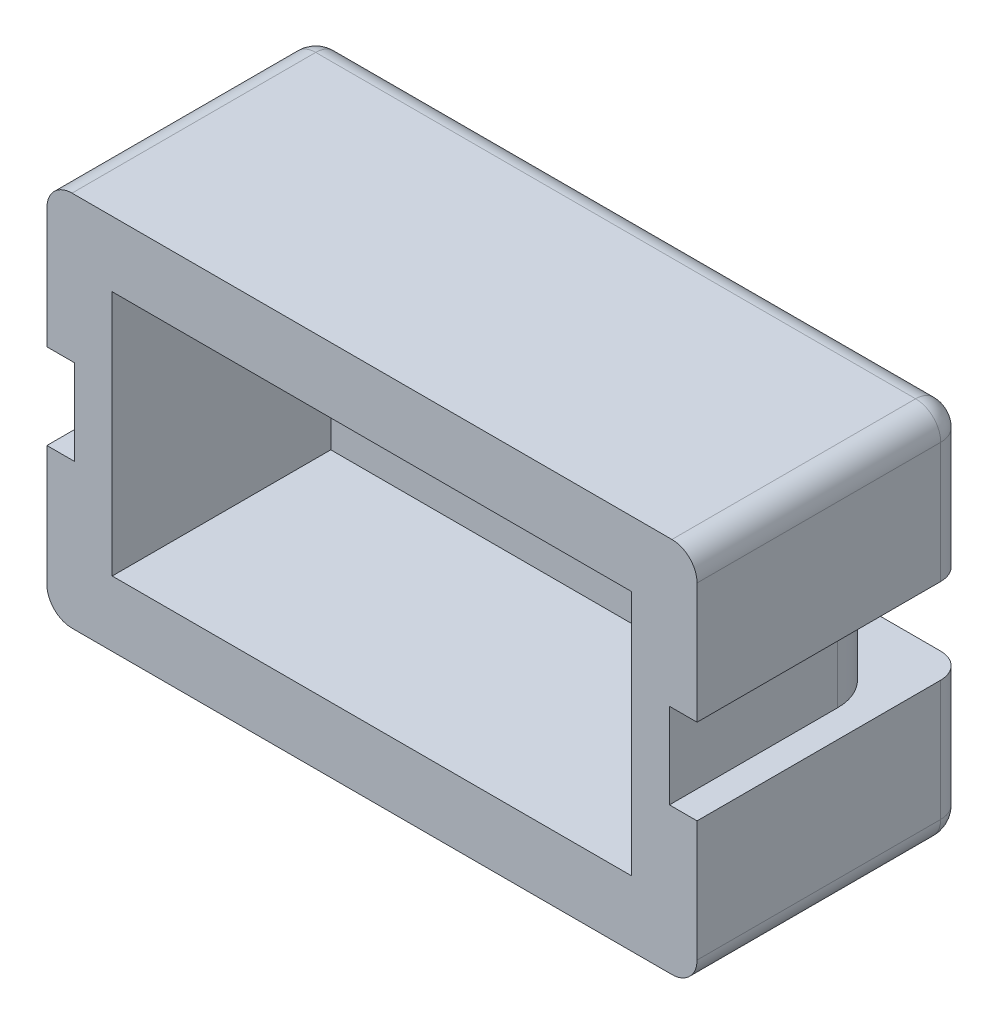
ISO-10303-21;
HEADER;
FILE_DESCRIPTION(('STEP AP214'),'2;1');
FILE_NAME('part.step','',(''),(''),'','','');
FILE_SCHEMA(('AUTOMOTIVE_DESIGN { 1 0 10303 214 1 1 1 1 }'));
ENDSEC;
DATA;
#1=APPLICATION_CONTEXT('core data for automotive mechanical design processes');
#2=APPLICATION_PROTOCOL_DEFINITION('international standard','automotive_design',2000,#1);
#3=PRODUCT_CONTEXT('',#1,'mechanical');
#4=PRODUCT('Part','Part','',(#3));
#5=PRODUCT_RELATED_PRODUCT_CATEGORY('part','',(#4));
#6=PRODUCT_DEFINITION_FORMATION('','',#4);
#7=PRODUCT_DEFINITION_CONTEXT('part definition',#1,'design');
#8=PRODUCT_DEFINITION('design','',#6,#7);
#9=PRODUCT_DEFINITION_SHAPE('','',#8);
#10=(LENGTH_UNIT() NAMED_UNIT(*) SI_UNIT(.MILLI.,.METRE.));
#11=(NAMED_UNIT(*) PLANE_ANGLE_UNIT() SI_UNIT($,.RADIAN.));
#12=(NAMED_UNIT(*) SI_UNIT($,.STERADIAN.) SOLID_ANGLE_UNIT());
#13=UNCERTAINTY_MEASURE_WITH_UNIT(LENGTH_MEASURE(1.E-05),#10,'distance_accuracy_value','');
#14=(GEOMETRIC_REPRESENTATION_CONTEXT(3) GLOBAL_UNCERTAINTY_ASSIGNED_CONTEXT((#13)) GLOBAL_UNIT_ASSIGNED_CONTEXT((#10,
#11,#12)) REPRESENTATION_CONTEXT('',''));
#15=CARTESIAN_POINT('',(0.,0.,0.));
#16=DIRECTION('',(0.,0.,1.));
#17=DIRECTION('',(1.,0.,0.));
#18=AXIS2_PLACEMENT_3D('',#15,#16,#17);
#19=CARTESIAN_POINT('',(-5.17,1.65,-16.7922725015619));
#20=DIRECTION('',(-1.,0.,0.));
#21=DIRECTION('',(0.,0.,1.));
#22=AXIS2_PLACEMENT_3D('',#19,#20,#21);
#23=PLANE('',#22);
#24=DIRECTION('',(0.,1.,0.));
#25=VECTOR('',#24,1.);
#26=CARTESIAN_POINT('',(-5.17,-15.7830852965656,-4.27870878105033));
#27=LINE('',#26,#25);
#28=CARTESIAN_POINT('',(-5.17,0.05,-4.27870878105033));
#29=VERTEX_POINT('',#28);
#30=CARTESIAN_POINT('',(-5.17,-1.65,-4.27870878105033));
#31=VERTEX_POINT('',#30);
#32=EDGE_CURVE('E13',#29,#31,#27,.F.);
#33=ORIENTED_EDGE('',*,*,#32,.F.);
#34=DIRECTION('',(0.,0.,1.));
#35=VECTOR('',#34,1.);
#36=CARTESIAN_POINT('',(-5.17,0.05,-4.35));
#37=LINE('',#36,#35);
#38=CARTESIAN_POINT('',(-5.17,0.05,-4.35));
#39=VERTEX_POINT('',#38);
#40=EDGE_CURVE('E289',#39,#29,#37,.T.);
#41=ORIENTED_EDGE('',*,*,#40,.F.);
#42=DIRECTION('',(0.,1.,0.));
#43=VECTOR('',#42,1.);
#44=CARTESIAN_POINT('',(-5.17,1.65,-4.35));
#45=LINE('',#44,#43);
#46=CARTESIAN_POINT('',(-5.17,1.65,-4.35));
#47=VERTEX_POINT('',#46);
#48=EDGE_CURVE('E298',#39,#47,#45,.T.);
#49=ORIENTED_EDGE('',*,*,#48,.T.);
#50=DIRECTION('',(0.,0.,1.));
#51=VECTOR('',#50,1.);
#52=CARTESIAN_POINT('',(-5.17,1.65,-16.7922725015619));
#53=LINE('',#52,#51);
#54=CARTESIAN_POINT('',(-5.17,1.65,0.));
#55=VERTEX_POINT('',#54);
#56=EDGE_CURVE('E319',#47,#55,#53,.T.);
#57=ORIENTED_EDGE('',*,*,#56,.T.);
#58=DIRECTION('',(0.,-1.,0.));
#59=VECTOR('',#58,1.);
#60=CARTESIAN_POINT('',(-5.17,1.65,0.));
#61=LINE('',#60,#59);
#62=CARTESIAN_POINT('',(-5.17,-3.25,0.));
#63=VERTEX_POINT('',#62);
#64=EDGE_CURVE('E314',#55,#63,#61,.T.);
#65=ORIENTED_EDGE('',*,*,#64,.T.);
#66=DIRECTION('',(0.,0.,1.));
#67=VECTOR('',#66,1.);
#68=CARTESIAN_POINT('',(-5.17,-3.25,-16.7922725015619));
#69=LINE('',#68,#67);
#70=CARTESIAN_POINT('',(-5.17,-3.25,-4.35));
#71=VERTEX_POINT('',#70);
#72=EDGE_CURVE('E299',#71,#63,#69,.T.);
#73=ORIENTED_EDGE('',*,*,#72,.F.);
#74=CARTESIAN_POINT('',(-5.17,-1.65,-4.35));
#75=VERTEX_POINT('',#74);
#76=EDGE_CURVE('E300',#71,#75,#45,.T.);
#77=ORIENTED_EDGE('',*,*,#76,.T.);
#78=DIRECTION('',(0.,0.,-1.));
#79=VECTOR('',#78,1.);
#80=CARTESIAN_POINT('',(-5.17,-1.65,-4.32979589711327));
#81=LINE('',#80,#79);
#82=EDGE_CURVE('E267',#31,#75,#81,.T.);
#83=ORIENTED_EDGE('',*,*,#82,.F.);
#84=EDGE_LOOP('',(#33,#41,#49,#57,#65,#73,#77,#83));
#85=FACE_BOUND('',#84,.T.);
#86=ADVANCED_FACE('F39',(#85),#23,.F.);
#87=CARTESIAN_POINT('',(5.17,-3.25,-16.7922725015619));
#88=DIRECTION('',(1.,0.,0.));
#89=DIRECTION('',(0.,0.,-1.));
#90=AXIS2_PLACEMENT_3D('',#87,#88,#89);
#91=PLANE('',#90);
#92=DIRECTION('',(0.,0.,-1.));
#93=VECTOR('',#92,1.);
#94=CARTESIAN_POINT('',(5.17,0.05,-4.32979589711327));
#95=LINE('',#94,#93);
#96=CARTESIAN_POINT('',(5.17,0.05,-4.27870878105033));
#97=VERTEX_POINT('',#96);
#98=CARTESIAN_POINT('',(5.17,0.05,-4.35));
#99=VERTEX_POINT('',#98);
#100=EDGE_CURVE('E285',#97,#99,#95,.T.);
#101=ORIENTED_EDGE('',*,*,#100,.F.);
#102=DIRECTION('',(0.,1.,0.));
#103=VECTOR('',#102,1.);
#104=CARTESIAN_POINT('',(5.17,-15.7830852965656,-4.27870878105033));
#105=LINE('',#104,#103);
#106=CARTESIAN_POINT('',(5.17,-1.65,-4.27870878105033));
#107=VERTEX_POINT('',#106);
#108=EDGE_CURVE('E47',#107,#97,#105,.T.);
#109=ORIENTED_EDGE('',*,*,#108,.F.);
#110=DIRECTION('',(0.,0.,1.));
#111=VECTOR('',#110,1.);
#112=CARTESIAN_POINT('',(5.17,-1.65,-4.35));
#113=LINE('',#112,#111);
#114=CARTESIAN_POINT('',(5.17,-1.65,-4.35));
#115=VERTEX_POINT('',#114);
#116=EDGE_CURVE('E271',#115,#107,#113,.T.);
#117=ORIENTED_EDGE('',*,*,#116,.F.);
#118=DIRECTION('',(0.,-1.,0.));
#119=VECTOR('',#118,1.);
#120=CARTESIAN_POINT('',(5.17,-3.25,-4.35));
#121=LINE('',#120,#119);
#122=CARTESIAN_POINT('',(5.17,-3.25,-4.35));
#123=VERTEX_POINT('',#122);
#124=EDGE_CURVE('E305',#115,#123,#121,.T.);
#125=ORIENTED_EDGE('',*,*,#124,.T.);
#126=DIRECTION('',(0.,0.,1.));
#127=VECTOR('',#126,1.);
#128=CARTESIAN_POINT('',(5.17,-3.25,-16.7922725015619));
#129=LINE('',#128,#127);
#130=CARTESIAN_POINT('',(5.17,-3.25,0.));
#131=VERTEX_POINT('',#130);
#132=EDGE_CURVE('E316',#123,#131,#129,.T.);
#133=ORIENTED_EDGE('',*,*,#132,.T.);
#134=DIRECTION('',(0.,1.,0.));
#135=VECTOR('',#134,1.);
#136=CARTESIAN_POINT('',(5.17,-3.25,0.));
#137=LINE('',#136,#135);
#138=CARTESIAN_POINT('',(5.17,1.65,0.));
#139=VERTEX_POINT('',#138);
#140=EDGE_CURVE('E308',#131,#139,#137,.T.);
#141=ORIENTED_EDGE('',*,*,#140,.T.);
#142=DIRECTION('',(0.,0.,1.));
#143=VECTOR('',#142,1.);
#144=CARTESIAN_POINT('',(5.17,1.65,-16.7922725015619));
#145=LINE('',#144,#143);
#146=CARTESIAN_POINT('',(5.17,1.65,-4.35));
#147=VERTEX_POINT('',#146);
#148=EDGE_CURVE('E321',#147,#139,#145,.T.);
#149=ORIENTED_EDGE('',*,*,#148,.F.);
#150=EDGE_CURVE('E326',#147,#99,#121,.T.);
#151=ORIENTED_EDGE('',*,*,#150,.T.);
#152=EDGE_LOOP('',(#101,#109,#117,#125,#133,#141,#149,#151));
#153=FACE_BOUND('',#152,.T.);
#154=ADVANCED_FACE('F472',(#153),#91,.F.);
#155=CARTESIAN_POINT('',(0.,0.,0.));
#156=DIRECTION('',(0.,0.,1.));
#157=DIRECTION('',(1.,0.,0.));
#158=AXIS2_PLACEMENT_3D('',#155,#156,#157);
#159=PLANE('',#158);
#160=DIRECTION('',(1.,0.,0.));
#161=VECTOR('',#160,1.);
#162=CARTESIAN_POINT('',(-5.17,-3.25,0.));
#163=LINE('',#162,#161);
#164=EDGE_CURVE('E306',#63,#131,#163,.T.);
#165=ORIENTED_EDGE('',*,*,#164,.F.);
#166=ORIENTED_EDGE('',*,*,#64,.F.);
#167=DIRECTION('',(-1.,0.,0.));
#168=VECTOR('',#167,1.);
#169=CARTESIAN_POINT('',(5.17,1.65,0.));
#170=LINE('',#169,#168);
#171=EDGE_CURVE('E311',#139,#55,#170,.T.);
#172=ORIENTED_EDGE('',*,*,#171,.F.);
#173=ORIENTED_EDGE('',*,*,#140,.F.);
#174=EDGE_LOOP('',(#165,#166,#172,#173));
#175=FACE_BOUND('',#174,.T.);
#176=DIRECTION('',(0.,1.,0.));
#177=VECTOR('',#176,1.);
#178=CARTESIAN_POINT('',(5.92,0.,0.));
#179=LINE('',#178,#177);
#180=CARTESIAN_POINT('',(5.92,-1.65,0.));
#181=VERTEX_POINT('',#180);
#182=CARTESIAN_POINT('',(5.92,0.05,0.));
#183=VERTEX_POINT('',#182);
#184=EDGE_CURVE('E434',#181,#183,#179,.T.);
#185=ORIENTED_EDGE('',*,*,#184,.T.);
#186=DIRECTION('',(-1.,0.,0.));
#187=VECTOR('',#186,1.);
#188=CARTESIAN_POINT('',(6.47,0.05,0.));
#189=LINE('',#188,#187);
#190=CARTESIAN_POINT('',(6.47,0.05,0.));
#191=VERTEX_POINT('',#190);
#192=EDGE_CURVE('E229',#191,#183,#189,.T.);
#193=ORIENTED_EDGE('',*,*,#192,.F.);
#194=DIRECTION('',(0.,1.,0.));
#195=VECTOR('',#194,1.);
#196=CARTESIAN_POINT('',(6.47,-4.55,0.));
#197=LINE('',#196,#195);
#198=CARTESIAN_POINT('',(6.47,2.45,0.));
#199=VERTEX_POINT('',#198);
#200=EDGE_CURVE('E336',#191,#199,#197,.T.);
#201=ORIENTED_EDGE('',*,*,#200,.T.);
#202=CARTESIAN_POINT('',(5.97,2.45,0.));
#203=DIRECTION('',(0.,0.,1.));
#204=DIRECTION('',(1.,0.,0.));
#205=AXIS2_PLACEMENT_3D('',#202,#203,#204);
#206=CIRCLE('',#205,0.5);
#207=CARTESIAN_POINT('',(5.97,2.95,0.));
#208=VERTEX_POINT('',#207);
#209=EDGE_CURVE('E355',#199,#208,#206,.T.);
#210=ORIENTED_EDGE('',*,*,#209,.T.);
#211=DIRECTION('',(-1.,0.,0.));
#212=VECTOR('',#211,1.);
#213=CARTESIAN_POINT('',(6.47,2.95,0.));
#214=LINE('',#213,#212);
#215=CARTESIAN_POINT('',(-5.97,2.95,0.));
#216=VERTEX_POINT('',#215);
#217=EDGE_CURVE('E340',#208,#216,#214,.T.);
#218=ORIENTED_EDGE('',*,*,#217,.T.);
#219=CARTESIAN_POINT('',(-5.97,2.45,0.));
#220=DIRECTION('',(0.,0.,1.));
#221=DIRECTION('',(1.,0.,0.));
#222=AXIS2_PLACEMENT_3D('',#219,#220,#221);
#223=CIRCLE('',#222,0.5);
#224=CARTESIAN_POINT('',(-6.47,2.45,0.));
#225=VERTEX_POINT('',#224);
#226=EDGE_CURVE('E353',#216,#225,#223,.T.);
#227=ORIENTED_EDGE('',*,*,#226,.T.);
#228=DIRECTION('',(0.,-1.,0.));
#229=VECTOR('',#228,1.);
#230=CARTESIAN_POINT('',(-6.47,-4.55,0.));
#231=LINE('',#230,#229);
#232=CARTESIAN_POINT('',(-6.47,0.05,0.));
#233=VERTEX_POINT('',#232);
#234=EDGE_CURVE('E330',#225,#233,#231,.T.);
#235=ORIENTED_EDGE('',*,*,#234,.T.);
#236=DIRECTION('',(-1.,0.,0.));
#237=VECTOR('',#236,1.);
#238=CARTESIAN_POINT('',(-5.97,0.05,0.));
#239=LINE('',#238,#237);
#240=CARTESIAN_POINT('',(-5.92,0.05,0.));
#241=VERTEX_POINT('',#240);
#242=EDGE_CURVE('E291',#241,#233,#239,.T.);
#243=ORIENTED_EDGE('',*,*,#242,.F.);
#244=DIRECTION('',(0.,-1.,0.));
#245=VECTOR('',#244,1.);
#246=CARTESIAN_POINT('',(-5.92,0.,0.));
#247=LINE('',#246,#245);
#248=CARTESIAN_POINT('',(-5.92,-1.65,0.));
#249=VERTEX_POINT('',#248);
#250=EDGE_CURVE('E409',#241,#249,#247,.T.);
#251=ORIENTED_EDGE('',*,*,#250,.T.);
#252=DIRECTION('',(1.,0.,0.));
#253=VECTOR('',#252,1.);
#254=CARTESIAN_POINT('',(-6.47,-1.65,0.));
#255=LINE('',#254,#253);
#256=CARTESIAN_POINT('',(-6.47,-1.65,0.));
#257=VERTEX_POINT('',#256);
#258=EDGE_CURVE('E265',#257,#249,#255,.T.);
#259=ORIENTED_EDGE('',*,*,#258,.F.);
#260=CARTESIAN_POINT('',(-6.47,-4.05,0.));
#261=VERTEX_POINT('',#260);
#262=EDGE_CURVE('E329',#257,#261,#231,.T.);
#263=ORIENTED_EDGE('',*,*,#262,.T.);
#264=CARTESIAN_POINT('',(-5.97,-4.05,0.));
#265=DIRECTION('',(0.,0.,1.));
#266=DIRECTION('',(1.,0.,0.));
#267=AXIS2_PLACEMENT_3D('',#264,#265,#266);
#268=CIRCLE('',#267,0.5);
#269=CARTESIAN_POINT('',(-5.97,-4.55,0.));
#270=VERTEX_POINT('',#269);
#271=EDGE_CURVE('E351',#261,#270,#268,.T.);
#272=ORIENTED_EDGE('',*,*,#271,.T.);
#273=DIRECTION('',(1.,0.,0.));
#274=VECTOR('',#273,1.);
#275=CARTESIAN_POINT('',(6.47,-4.55,0.));
#276=LINE('',#275,#274);
#277=CARTESIAN_POINT('',(5.97,-4.55,0.));
#278=VERTEX_POINT('',#277);
#279=EDGE_CURVE('E333',#270,#278,#276,.T.);
#280=ORIENTED_EDGE('',*,*,#279,.T.);
#281=CARTESIAN_POINT('',(5.97,-4.05,0.));
#282=DIRECTION('',(0.,0.,1.));
#283=DIRECTION('',(1.,0.,0.));
#284=AXIS2_PLACEMENT_3D('',#281,#282,#283);
#285=CIRCLE('',#284,0.5);
#286=CARTESIAN_POINT('',(6.47,-4.05,0.));
#287=VERTEX_POINT('',#286);
#288=EDGE_CURVE('E349',#278,#287,#285,.T.);
#289=ORIENTED_EDGE('',*,*,#288,.T.);
#290=CARTESIAN_POINT('',(6.47,-1.65,0.));
#291=VERTEX_POINT('',#290);
#292=EDGE_CURVE('E337',#287,#291,#197,.T.);
#293=ORIENTED_EDGE('',*,*,#292,.T.);
#294=DIRECTION('',(1.,0.,0.));
#295=VECTOR('',#294,1.);
#296=CARTESIAN_POINT('',(5.97,-1.65,0.));
#297=LINE('',#296,#295);
#298=EDGE_CURVE('E273',#181,#291,#297,.T.);
#299=ORIENTED_EDGE('',*,*,#298,.F.);
#300=EDGE_LOOP('',(#185,#193,#201,#210,#218,#227,#235,#243,#251,#259,#263,#272,#280,#289,#293,#299));
#301=FACE_BOUND('',#300,.T.);
#302=ADVANCED_FACE('F436',(#175,#301),#159,.T.);
#303=CARTESIAN_POINT('',(0.,0.,-4.35));
#304=DIRECTION('',(0.,0.,1.));
#305=DIRECTION('',(1.,0.,0.));
#306=AXIS2_PLACEMENT_3D('',#303,#304,#305);
#307=PLANE('',#306);
#308=ORIENTED_EDGE('',*,*,#124,.F.);
#309=DIRECTION('',(1.,0.,0.));
#310=VECTOR('',#309,1.);
#311=CARTESIAN_POINT('',(-5.17,-1.65,-4.35));
#312=LINE('',#311,#310);
#313=EDGE_CURVE('E269',#75,#115,#312,.T.);
#314=ORIENTED_EDGE('',*,*,#313,.F.);
#315=ORIENTED_EDGE('',*,*,#76,.F.);
#316=DIRECTION('',(-1.,0.,0.));
#317=VECTOR('',#316,1.);
#318=CARTESIAN_POINT('',(-5.17,-3.25,-4.35));
#319=LINE('',#318,#317);
#320=EDGE_CURVE('E303',#123,#71,#319,.T.);
#321=ORIENTED_EDGE('',*,*,#320,.F.);
#322=EDGE_LOOP('',(#308,#314,#315,#321));
#323=FACE_BOUND('',#322,.T.);
#324=ADVANCED_FACE('F468',(#323),#307,.T.);
#325=CARTESIAN_POINT('',(-6.47,-4.55,-5.35));
#326=DIRECTION('',(-1.,0.,0.));
#327=DIRECTION('',(0.,0.,1.));
#328=AXIS2_PLACEMENT_3D('',#325,#326,#327);
#329=PLANE('',#328);
#330=ORIENTED_EDGE('',*,*,#262,.F.);
#331=DIRECTION('',(0.,0.,1.));
#332=VECTOR('',#331,1.);
#333=CARTESIAN_POINT('',(-6.47,-1.65,-4.85));
#334=LINE('',#333,#332);
#335=CARTESIAN_POINT('',(-6.47,-1.65,-4.85));
#336=VERTEX_POINT('',#335);
#337=EDGE_CURVE('E263',#336,#257,#334,.T.);
#338=ORIENTED_EDGE('',*,*,#337,.F.);
#339=DIRECTION('',(0.,-1.,0.));
#340=VECTOR('',#339,1.);
#341=CARTESIAN_POINT('',(-6.47,-4.05,-4.85));
#342=LINE('',#341,#340);
#343=CARTESIAN_POINT('',(-6.47,-4.05,-4.85));
#344=VERTEX_POINT('',#343);
#345=EDGE_CURVE('E391',#336,#344,#342,.T.);
#346=ORIENTED_EDGE('',*,*,#345,.T.);
#347=DIRECTION('',(0.,0.,1.));
#348=VECTOR('',#347,1.);
#349=CARTESIAN_POINT('',(-6.47,-4.05,-5.35));
#350=LINE('',#349,#348);
#351=EDGE_CURVE('E362',#344,#261,#350,.T.);
#352=ORIENTED_EDGE('',*,*,#351,.T.);
#353=EDGE_LOOP('',(#330,#338,#346,#352));
#354=FACE_BOUND('',#353,.T.);
#355=ADVANCED_FACE('F600',(#354),#329,.T.);
#356=CARTESIAN_POINT('',(6.47,-4.55,-5.35));
#357=DIRECTION('',(1.,0.,0.));
#358=DIRECTION('',(0.,0.,-1.));
#359=AXIS2_PLACEMENT_3D('',#356,#357,#358);
#360=PLANE('',#359);
#361=DIRECTION('',(0.,1.,0.));
#362=VECTOR('',#361,1.);
#363=CARTESIAN_POINT('',(6.47,-1.6,-4.85));
#364=LINE('',#363,#362);
#365=CARTESIAN_POINT('',(6.47,-4.05,-4.85));
#366=VERTEX_POINT('',#365);
#367=CARTESIAN_POINT('',(6.47,-1.65,-4.85));
#368=VERTEX_POINT('',#367);
#369=EDGE_CURVE('E404',#366,#368,#364,.T.);
#370=ORIENTED_EDGE('',*,*,#369,.T.);
#371=DIRECTION('',(0.,0.,-1.));
#372=VECTOR('',#371,1.);
#373=CARTESIAN_POINT('',(6.47,-1.65,0.));
#374=LINE('',#373,#372);
#375=EDGE_CURVE('E275',#291,#368,#374,.T.);
#376=ORIENTED_EDGE('',*,*,#375,.F.);
#377=ORIENTED_EDGE('',*,*,#292,.F.);
#378=DIRECTION('',(0.,0.,1.));
#379=VECTOR('',#378,1.);
#380=CARTESIAN_POINT('',(6.47,-4.05,-5.35));
#381=LINE('',#380,#379);
#382=EDGE_CURVE('E343',#287,#366,#381,.F.);
#383=ORIENTED_EDGE('',*,*,#382,.T.);
#384=EDGE_LOOP('',(#370,#376,#377,#383));
#385=FACE_BOUND('',#384,.T.);
#386=ADVANCED_FACE('F606',(#385),#360,.T.);
#387=CARTESIAN_POINT('',(0.,0.,-5.35));
#388=DIRECTION('',(0.,0.,1.));
#389=DIRECTION('',(1.,0.,0.));
#390=AXIS2_PLACEMENT_3D('',#387,#388,#389);
#391=PLANE('',#390);
#392=DIRECTION('',(-1.,0.,0.));
#393=VECTOR('',#392,1.);
#394=CARTESIAN_POINT('',(5.97,-1.65,-5.35));
#395=LINE('',#394,#393);
#396=CARTESIAN_POINT('',(5.97,-1.65,-5.35));
#397=VERTEX_POINT('',#396);
#398=CARTESIAN_POINT('',(-5.97,-1.65,-5.35));
#399=VERTEX_POINT('',#398);
#400=EDGE_CURVE('E54',#397,#399,#395,.T.);
#401=ORIENTED_EDGE('',*,*,#400,.F.);
#402=DIRECTION('',(0.,1.,0.));
#403=VECTOR('',#402,1.);
#404=CARTESIAN_POINT('',(5.97,-4.05,-5.35));
#405=LINE('',#404,#403);
#406=CARTESIAN_POINT('',(5.97,-4.05,-5.35));
#407=VERTEX_POINT('',#406);
#408=EDGE_CURVE('E393',#397,#407,#405,.F.);
#409=ORIENTED_EDGE('',*,*,#408,.T.);
#410=DIRECTION('',(1.,0.,0.));
#411=VECTOR('',#410,1.);
#412=CARTESIAN_POINT('',(-5.97,-4.05,-5.35));
#413=LINE('',#412,#411);
#414=CARTESIAN_POINT('',(-5.97,-4.05,-5.35));
#415=VERTEX_POINT('',#414);
#416=EDGE_CURVE('E395',#407,#415,#413,.F.);
#417=ORIENTED_EDGE('',*,*,#416,.T.);
#418=DIRECTION('',(0.,-1.,0.));
#419=VECTOR('',#418,1.);
#420=CARTESIAN_POINT('',(-5.97,-1.6,-5.35));
#421=LINE('',#420,#419);
#422=EDGE_CURVE('E397',#415,#399,#421,.F.);
#423=ORIENTED_EDGE('',*,*,#422,.T.);
#424=EDGE_LOOP('',(#401,#409,#417,#423));
#425=FACE_BOUND('',#424,.T.);
#426=ADVANCED_FACE('F615',(#425),#391,.F.);
#427=CARTESIAN_POINT('',(5.97,-4.55,-4.85));
#428=DIRECTION('',(0.,-1.,0.));
#429=DIRECTION('',(0.,0.,-1.));
#430=AXIS2_PLACEMENT_3D('',#427,#428,#429);
#431=CYLINDRICAL_SURFACE('',#430,0.5);
#432=ORIENTED_EDGE('',*,*,#408,.F.);
#433=CARTESIAN_POINT('',(5.97,-1.65,-4.85));
#434=DIRECTION('',(0.,1.,0.));
#435=DIRECTION('',(-1.,0.,0.));
#436=AXIS2_PLACEMENT_3D('',#433,#434,#435);
#437=CIRCLE('',#436,0.5);
#438=EDGE_CURVE('E258',#368,#397,#437,.T.);
#439=ORIENTED_EDGE('',*,*,#438,.F.);
#440=ORIENTED_EDGE('',*,*,#369,.F.);
#441=CARTESIAN_POINT('',(5.97,-4.05,-4.85));
#442=DIRECTION('',(0.,-1.,0.));
#443=DIRECTION('',(0.,0.,-1.));
#444=AXIS2_PLACEMENT_3D('',#441,#442,#443);
#445=CIRCLE('',#444,0.5);
#446=EDGE_CURVE('E414',#407,#366,#445,.T.);
#447=ORIENTED_EDGE('',*,*,#446,.F.);
#448=EDGE_LOOP('',(#432,#439,#440,#447));
#449=FACE_BOUND('',#448,.T.);
#450=ADVANCED_FACE('F41',(#449),#431,.T.);
#451=CARTESIAN_POINT('',(-5.97,-4.55,-4.85));
#452=DIRECTION('',(0.,1.,0.));
#453=DIRECTION('',(0.,0.,1.));
#454=AXIS2_PLACEMENT_3D('',#451,#452,#453);
#455=CYLINDRICAL_SURFACE('',#454,0.5);
#456=ORIENTED_EDGE('',*,*,#345,.F.);
#457=CARTESIAN_POINT('',(-5.97,-1.65,-4.85));
#458=DIRECTION('',(0.,1.,0.));
#459=DIRECTION('',(-1.,0.,0.));
#460=AXIS2_PLACEMENT_3D('',#457,#458,#459);
#461=CIRCLE('',#460,0.5);
#462=EDGE_CURVE('E261',#399,#336,#461,.T.);
#463=ORIENTED_EDGE('',*,*,#462,.F.);
#464=ORIENTED_EDGE('',*,*,#422,.F.);
#465=CARTESIAN_POINT('',(-5.97,-4.05,-4.85));
#466=DIRECTION('',(0.,1.,0.));
#467=DIRECTION('',(0.,0.,1.));
#468=AXIS2_PLACEMENT_3D('',#465,#466,#467);
#469=CIRCLE('',#468,0.5);
#470=EDGE_CURVE('E295',#415,#344,#469,.T.);
#471=ORIENTED_EDGE('',*,*,#470,.T.);
#472=EDGE_LOOP('',(#456,#463,#464,#471));
#473=FACE_BOUND('',#472,.T.);
#474=ADVANCED_FACE('F581',(#473),#455,.T.);
#475=DIRECTION('',(0.,-1.,0.));
#476=VECTOR('',#475,1.);
#477=CARTESIAN_POINT('',(-6.47,0.,-4.85));
#478=LINE('',#477,#476);
#479=CARTESIAN_POINT('',(-6.47,2.45,-4.85));
#480=VERTEX_POINT('',#479);
#481=CARTESIAN_POINT('',(-6.47,0.05,-4.85));
#482=VERTEX_POINT('',#481);
#483=EDGE_CURVE('E382',#480,#482,#478,.T.);
#484=ORIENTED_EDGE('',*,*,#483,.T.);
#485=DIRECTION('',(0.,0.,-1.));
#486=VECTOR('',#485,1.);
#487=CARTESIAN_POINT('',(-6.47,0.05,0.));
#488=LINE('',#487,#486);
#489=EDGE_CURVE('E293',#233,#482,#488,.T.);
#490=ORIENTED_EDGE('',*,*,#489,.F.);
#491=ORIENTED_EDGE('',*,*,#234,.F.);
#492=DIRECTION('',(0.,0.,1.));
#493=VECTOR('',#492,1.);
#494=CARTESIAN_POINT('',(-6.47,2.45,-5.35));
#495=LINE('',#494,#493);
#496=EDGE_CURVE('E365',#225,#480,#495,.F.);
#497=ORIENTED_EDGE('',*,*,#496,.T.);
#498=EDGE_LOOP('',(#484,#490,#491,#497));
#499=FACE_BOUND('',#498,.T.);
#500=ADVANCED_FACE('F609',(#499),#329,.T.);
#501=ORIENTED_EDGE('',*,*,#200,.F.);
#502=DIRECTION('',(0.,0.,1.));
#503=VECTOR('',#502,1.);
#504=CARTESIAN_POINT('',(6.47,0.05,-4.85));
#505=LINE('',#504,#503);
#506=CARTESIAN_POINT('',(6.47,0.05,-4.85));
#507=VERTEX_POINT('',#506);
#508=EDGE_CURVE('E282',#507,#191,#505,.T.);
#509=ORIENTED_EDGE('',*,*,#508,.F.);
#510=DIRECTION('',(0.,1.,0.));
#511=VECTOR('',#510,1.);
#512=CARTESIAN_POINT('',(6.47,2.45,-4.85));
#513=LINE('',#512,#511);
#514=CARTESIAN_POINT('',(6.47,2.45,-4.85));
#515=VERTEX_POINT('',#514);
#516=EDGE_CURVE('E373',#507,#515,#513,.T.);
#517=ORIENTED_EDGE('',*,*,#516,.T.);
#518=DIRECTION('',(0.,0.,1.));
#519=VECTOR('',#518,1.);
#520=CARTESIAN_POINT('',(6.47,2.45,-5.35));
#521=LINE('',#520,#519);
#522=EDGE_CURVE('E346',#515,#199,#521,.T.);
#523=ORIENTED_EDGE('',*,*,#522,.T.);
#524=EDGE_LOOP('',(#501,#509,#517,#523));
#525=FACE_BOUND('',#524,.T.);
#526=ADVANCED_FACE('F618',(#525),#360,.T.);
#527=DIRECTION('',(1.,0.,0.));
#528=VECTOR('',#527,1.);
#529=CARTESIAN_POINT('',(-5.97,0.05,-5.35));
#530=LINE('',#529,#528);
#531=CARTESIAN_POINT('',(-5.97,0.05,-5.35));
#532=VERTEX_POINT('',#531);
#533=CARTESIAN_POINT('',(5.97,0.0499999999999997,-5.35));
#534=VERTEX_POINT('',#533);
#535=EDGE_CURVE('E62',#532,#534,#530,.T.);
#536=ORIENTED_EDGE('',*,*,#535,.F.);
#537=DIRECTION('',(0.,-1.,0.));
#538=VECTOR('',#537,1.);
#539=CARTESIAN_POINT('',(-5.97,2.45,-5.35));
#540=LINE('',#539,#538);
#541=CARTESIAN_POINT('',(-5.97,2.45,-5.35));
#542=VERTEX_POINT('',#541);
#543=EDGE_CURVE('E377',#532,#542,#540,.F.);
#544=ORIENTED_EDGE('',*,*,#543,.T.);
#545=DIRECTION('',(-1.,0.,0.));
#546=VECTOR('',#545,1.);
#547=CARTESIAN_POINT('',(5.97,2.45,-5.35));
#548=LINE('',#547,#546);
#549=CARTESIAN_POINT('',(5.97,2.45,-5.35));
#550=VERTEX_POINT('',#549);
#551=EDGE_CURVE('E375',#542,#550,#548,.F.);
#552=ORIENTED_EDGE('',*,*,#551,.T.);
#553=DIRECTION('',(0.,1.,0.));
#554=VECTOR('',#553,1.);
#555=CARTESIAN_POINT('',(5.97,0.,-5.35));
#556=LINE('',#555,#554);
#557=EDGE_CURVE('E379',#550,#534,#556,.F.);
#558=ORIENTED_EDGE('',*,*,#557,.T.);
#559=EDGE_LOOP('',(#536,#544,#552,#558));
#560=FACE_BOUND('',#559,.T.);
#561=ADVANCED_FACE('F512',(#560),#391,.F.);
#562=ORIENTED_EDGE('',*,*,#48,.F.);
#563=DIRECTION('',(-1.,0.,0.));
#564=VECTOR('',#563,1.);
#565=CARTESIAN_POINT('',(5.17,0.05,-4.35));
#566=LINE('',#565,#564);
#567=EDGE_CURVE('E287',#99,#39,#566,.T.);
#568=ORIENTED_EDGE('',*,*,#567,.F.);
#569=ORIENTED_EDGE('',*,*,#150,.F.);
#570=DIRECTION('',(1.,0.,0.));
#571=VECTOR('',#570,1.);
#572=CARTESIAN_POINT('',(5.17,1.65,-4.35));
#573=LINE('',#572,#571);
#574=EDGE_CURVE('E296',#47,#147,#573,.T.);
#575=ORIENTED_EDGE('',*,*,#574,.F.);
#576=EDGE_LOOP('',(#562,#568,#569,#575));
#577=FACE_BOUND('',#576,.T.);
#578=ADVANCED_FACE('F478',(#577),#307,.T.);
#579=CARTESIAN_POINT('',(-5.97,-4.55,-4.85));
#580=DIRECTION('',(0.,1.,0.));
#581=DIRECTION('',(0.,0.,1.));
#582=AXIS2_PLACEMENT_3D('',#579,#580,#581);
#583=CYLINDRICAL_SURFACE('',#582,0.5);
#584=ORIENTED_EDGE('',*,*,#543,.F.);
#585=CARTESIAN_POINT('',(-5.97,0.05,-4.85));
#586=DIRECTION('',(0.,-1.,0.));
#587=DIRECTION('',(0.,0.,-1.));
#588=AXIS2_PLACEMENT_3D('',#585,#586,#587);
#589=CIRCLE('',#588,0.5);
#590=EDGE_CURVE('E277',#482,#532,#589,.T.);
#591=ORIENTED_EDGE('',*,*,#590,.F.);
#592=ORIENTED_EDGE('',*,*,#483,.F.);
#593=CARTESIAN_POINT('',(-5.97,2.45,-4.85));
#594=DIRECTION('',(0.,1.,0.));
#595=DIRECTION('',(0.,0.,1.));
#596=AXIS2_PLACEMENT_3D('',#593,#594,#595);
#597=CIRCLE('',#596,0.5);
#598=EDGE_CURVE('E309',#542,#480,#597,.T.);
#599=ORIENTED_EDGE('',*,*,#598,.F.);
#600=EDGE_LOOP('',(#584,#591,#592,#599));
#601=FACE_BOUND('',#600,.T.);
#602=ADVANCED_FACE('F511',(#601),#583,.T.);
#603=CARTESIAN_POINT('',(5.97,-4.55,-4.85));
#604=DIRECTION('',(0.,-1.,0.));
#605=DIRECTION('',(0.,0.,-1.));
#606=AXIS2_PLACEMENT_3D('',#603,#604,#605);
#607=CYLINDRICAL_SURFACE('',#606,0.5);
#608=ORIENTED_EDGE('',*,*,#516,.F.);
#609=CARTESIAN_POINT('',(5.97,0.05,-4.85));
#610=DIRECTION('',(0.,-1.,0.));
#611=DIRECTION('',(0.,0.,-1.));
#612=AXIS2_PLACEMENT_3D('',#609,#610,#611);
#613=CIRCLE('',#612,0.5);
#614=EDGE_CURVE('E280',#534,#507,#613,.T.);
#615=ORIENTED_EDGE('',*,*,#614,.F.);
#616=ORIENTED_EDGE('',*,*,#557,.F.);
#617=CARTESIAN_POINT('',(5.97,2.45,-4.85));
#618=DIRECTION('',(0.,-1.,0.));
#619=DIRECTION('',(0.,0.,-1.));
#620=AXIS2_PLACEMENT_3D('',#617,#618,#619);
#621=CIRCLE('',#620,0.5);
#622=EDGE_CURVE('E410',#550,#515,#621,.T.);
#623=ORIENTED_EDGE('',*,*,#622,.T.);
#624=EDGE_LOOP('',(#608,#615,#616,#623));
#625=FACE_BOUND('',#624,.T.);
#626=ADVANCED_FACE('F660',(#625),#607,.T.);
#627=CARTESIAN_POINT('',(6.47,2.95,-5.35));
#628=DIRECTION('',(0.,1.,0.));
#629=DIRECTION('',(0.,0.,1.));
#630=AXIS2_PLACEMENT_3D('',#627,#628,#629);
#631=PLANE('',#630);
#632=DIRECTION('',(0.,0.,1.));
#633=VECTOR('',#632,1.);
#634=CARTESIAN_POINT('',(5.97,2.95,-5.35));
#635=LINE('',#634,#633);
#636=CARTESIAN_POINT('',(5.97,2.95,-4.85));
#637=VERTEX_POINT('',#636);
#638=EDGE_CURVE('E359',#208,#637,#635,.F.);
#639=ORIENTED_EDGE('',*,*,#638,.T.);
#640=DIRECTION('',(-1.,0.,0.));
#641=VECTOR('',#640,1.);
#642=CARTESIAN_POINT('',(-5.97,2.95,-4.85));
#643=LINE('',#642,#641);
#644=CARTESIAN_POINT('',(-5.97,2.95,-4.85));
#645=VERTEX_POINT('',#644);
#646=EDGE_CURVE('E387',#637,#645,#643,.T.);
#647=ORIENTED_EDGE('',*,*,#646,.T.);
#648=DIRECTION('',(0.,0.,1.));
#649=VECTOR('',#648,1.);
#650=CARTESIAN_POINT('',(-5.97,2.95,-5.35));
#651=LINE('',#650,#649);
#652=EDGE_CURVE('E357',#645,#216,#651,.T.);
#653=ORIENTED_EDGE('',*,*,#652,.T.);
#654=ORIENTED_EDGE('',*,*,#217,.F.);
#655=EDGE_LOOP('',(#639,#647,#653,#654));
#656=FACE_BOUND('',#655,.T.);
#657=ADVANCED_FACE('F667',(#656),#631,.T.);
#658=CARTESIAN_POINT('',(6.47,-4.55,-5.35));
#659=DIRECTION('',(0.,-1.,0.));
#660=DIRECTION('',(0.,0.,-1.));
#661=AXIS2_PLACEMENT_3D('',#658,#659,#660);
#662=PLANE('',#661);
#663=DIRECTION('',(0.,0.,1.));
#664=VECTOR('',#663,1.);
#665=CARTESIAN_POINT('',(-5.97,-4.55,-5.35));
#666=LINE('',#665,#664);
#667=CARTESIAN_POINT('',(-5.97,-4.55,-4.85));
#668=VERTEX_POINT('',#667);
#669=EDGE_CURVE('E370',#270,#668,#666,.F.);
#670=ORIENTED_EDGE('',*,*,#669,.T.);
#671=DIRECTION('',(1.,0.,0.));
#672=VECTOR('',#671,1.);
#673=CARTESIAN_POINT('',(5.97,-4.55,-4.85));
#674=LINE('',#673,#672);
#675=CARTESIAN_POINT('',(5.97,-4.55,-4.85));
#676=VERTEX_POINT('',#675);
#677=EDGE_CURVE('E402',#668,#676,#674,.T.);
#678=ORIENTED_EDGE('',*,*,#677,.T.);
#679=DIRECTION('',(0.,0.,1.));
#680=VECTOR('',#679,1.);
#681=CARTESIAN_POINT('',(5.97,-4.55,-5.35));
#682=LINE('',#681,#680);
#683=EDGE_CURVE('E368',#676,#278,#682,.T.);
#684=ORIENTED_EDGE('',*,*,#683,.T.);
#685=ORIENTED_EDGE('',*,*,#279,.F.);
#686=EDGE_LOOP('',(#670,#678,#684,#685));
#687=FACE_BOUND('',#686,.T.);
#688=ADVANCED_FACE('F675',(#687),#662,.T.);
#689=CARTESIAN_POINT('',(5.97,2.45,-5.35));
#690=DIRECTION('',(0.,0.,1.));
#691=DIRECTION('',(1.,0.,0.));
#692=AXIS2_PLACEMENT_3D('',#689,#690,#691);
#693=CYLINDRICAL_SURFACE('',#692,0.5);
#694=ORIENTED_EDGE('',*,*,#522,.F.);
#695=CARTESIAN_POINT('',(5.97,2.45,-4.85));
#696=DIRECTION('',(0.,0.,1.));
#697=DIRECTION('',(1.,0.,0.));
#698=AXIS2_PLACEMENT_3D('',#695,#696,#697);
#699=CIRCLE('',#698,0.5);
#700=EDGE_CURVE('E389',#515,#637,#699,.T.);
#701=ORIENTED_EDGE('',*,*,#700,.T.);
#702=ORIENTED_EDGE('',*,*,#638,.F.);
#703=ORIENTED_EDGE('',*,*,#209,.F.);
#704=EDGE_LOOP('',(#694,#701,#702,#703));
#705=FACE_BOUND('',#704,.T.);
#706=ADVANCED_FACE('F684',(#705),#693,.T.);
#707=CARTESIAN_POINT('',(-5.97,2.45,-5.35));
#708=DIRECTION('',(0.,0.,1.));
#709=DIRECTION('',(1.,0.,0.));
#710=AXIS2_PLACEMENT_3D('',#707,#708,#709);
#711=CYLINDRICAL_SURFACE('',#710,0.5);
#712=ORIENTED_EDGE('',*,*,#652,.F.);
#713=CARTESIAN_POINT('',(-5.97,2.45,-4.85));
#714=DIRECTION('',(0.,0.,1.));
#715=DIRECTION('',(1.,0.,0.));
#716=AXIS2_PLACEMENT_3D('',#713,#714,#715);
#717=CIRCLE('',#716,0.5);
#718=EDGE_CURVE('E385',#645,#480,#717,.T.);
#719=ORIENTED_EDGE('',*,*,#718,.T.);
#720=ORIENTED_EDGE('',*,*,#496,.F.);
#721=ORIENTED_EDGE('',*,*,#226,.F.);
#722=EDGE_LOOP('',(#712,#719,#720,#721));
#723=FACE_BOUND('',#722,.T.);
#724=ADVANCED_FACE('F692',(#723),#711,.T.);
#725=CARTESIAN_POINT('',(-5.97,-4.05,-5.35));
#726=DIRECTION('',(0.,0.,1.));
#727=DIRECTION('',(1.,0.,0.));
#728=AXIS2_PLACEMENT_3D('',#725,#726,#727);
#729=CYLINDRICAL_SURFACE('',#728,0.5);
#730=ORIENTED_EDGE('',*,*,#351,.F.);
#731=CARTESIAN_POINT('',(-5.97,-4.05,-4.85));
#732=DIRECTION('',(0.,0.,1.));
#733=DIRECTION('',(1.,0.,0.));
#734=AXIS2_PLACEMENT_3D('',#731,#732,#733);
#735=CIRCLE('',#734,0.5);
#736=EDGE_CURVE('E400',#344,#668,#735,.T.);
#737=ORIENTED_EDGE('',*,*,#736,.T.);
#738=ORIENTED_EDGE('',*,*,#669,.F.);
#739=ORIENTED_EDGE('',*,*,#271,.F.);
#740=EDGE_LOOP('',(#730,#737,#738,#739));
#741=FACE_BOUND('',#740,.T.);
#742=ADVANCED_FACE('F498',(#741),#729,.T.);
#743=CARTESIAN_POINT('',(5.97,-4.05,-5.35));
#744=DIRECTION('',(0.,0.,1.));
#745=DIRECTION('',(1.,0.,0.));
#746=AXIS2_PLACEMENT_3D('',#743,#744,#745);
#747=CYLINDRICAL_SURFACE('',#746,0.5);
#748=ORIENTED_EDGE('',*,*,#683,.F.);
#749=CARTESIAN_POINT('',(5.97,-4.05,-4.85));
#750=DIRECTION('',(0.,0.,1.));
#751=DIRECTION('',(1.,0.,0.));
#752=AXIS2_PLACEMENT_3D('',#749,#750,#751);
#753=CIRCLE('',#752,0.5);
#754=EDGE_CURVE('E407',#676,#366,#753,.T.);
#755=ORIENTED_EDGE('',*,*,#754,.T.);
#756=ORIENTED_EDGE('',*,*,#382,.F.);
#757=ORIENTED_EDGE('',*,*,#288,.F.);
#758=EDGE_LOOP('',(#748,#755,#756,#757));
#759=FACE_BOUND('',#758,.T.);
#760=ADVANCED_FACE('F490',(#759),#747,.T.);
#761=CARTESIAN_POINT('',(-5.17,-3.25,-16.7922725015619));
#762=DIRECTION('',(0.,-1.,0.));
#763=DIRECTION('',(0.,0.,-1.));
#764=AXIS2_PLACEMENT_3D('',#761,#762,#763);
#765=PLANE('',#764);
#766=ORIENTED_EDGE('',*,*,#320,.T.);
#767=ORIENTED_EDGE('',*,*,#72,.T.);
#768=ORIENTED_EDGE('',*,*,#164,.T.);
#769=ORIENTED_EDGE('',*,*,#132,.F.);
#770=EDGE_LOOP('',(#766,#767,#768,#769));
#771=FACE_BOUND('',#770,.T.);
#772=ADVANCED_FACE('F488',(#771),#765,.F.);
#773=CARTESIAN_POINT('',(5.17,1.65,-16.7922725015619));
#774=DIRECTION('',(0.,1.,0.));
#775=DIRECTION('',(0.,0.,1.));
#776=AXIS2_PLACEMENT_3D('',#773,#774,#775);
#777=PLANE('',#776);
#778=ORIENTED_EDGE('',*,*,#574,.T.);
#779=ORIENTED_EDGE('',*,*,#148,.T.);
#780=ORIENTED_EDGE('',*,*,#171,.T.);
#781=ORIENTED_EDGE('',*,*,#56,.F.);
#782=EDGE_LOOP('',(#778,#779,#780,#781));
#783=FACE_BOUND('',#782,.T.);
#784=ADVANCED_FACE('F484',(#783),#777,.F.);
#785=CARTESIAN_POINT('',(-5.97,2.45,-4.85));
#786=DIRECTION('',(0.,0.,1.));
#787=DIRECTION('',(1.,0.,0.));
#788=AXIS2_PLACEMENT_3D('',#785,#786,#787);
#789=SPHERICAL_SURFACE('',#788,0.5);
#790=ORIENTED_EDGE('',*,*,#598,.T.);
#791=ORIENTED_EDGE('',*,*,#718,.F.);
#792=CARTESIAN_POINT('',(-5.97,2.45,-4.85));
#793=DIRECTION('',(1.,0.,0.));
#794=DIRECTION('',(0.,0.,-1.));
#795=AXIS2_PLACEMENT_3D('',#792,#793,#794);
#796=CIRCLE('',#795,0.5);
#797=EDGE_CURVE('E417',#542,#645,#796,.T.);
#798=ORIENTED_EDGE('',*,*,#797,.F.);
#799=EDGE_LOOP('',(#790,#791,#798));
#800=FACE_BOUND('',#799,.T.);
#801=ADVANCED_FACE('F496',(#800),#789,.T.);
#802=CARTESIAN_POINT('',(6.47,2.45,-4.85));
#803=DIRECTION('',(1.,0.,0.));
#804=DIRECTION('',(0.,0.,-1.));
#805=AXIS2_PLACEMENT_3D('',#802,#803,#804);
#806=CYLINDRICAL_SURFACE('',#805,0.5);
#807=ORIENTED_EDGE('',*,*,#797,.T.);
#808=ORIENTED_EDGE('',*,*,#646,.F.);
#809=CARTESIAN_POINT('',(5.97,2.45,-4.85));
#810=DIRECTION('',(1.,0.,0.));
#811=DIRECTION('',(0.,0.,-1.));
#812=AXIS2_PLACEMENT_3D('',#809,#810,#811);
#813=CIRCLE('',#812,0.5);
#814=EDGE_CURVE('E413',#550,#637,#813,.T.);
#815=ORIENTED_EDGE('',*,*,#814,.F.);
#816=ORIENTED_EDGE('',*,*,#551,.F.);
#817=EDGE_LOOP('',(#807,#808,#815,#816));
#818=FACE_BOUND('',#817,.T.);
#819=ADVANCED_FACE('F722',(#818),#806,.T.);
#820=CARTESIAN_POINT('',(5.97,2.45,-4.85));
#821=DIRECTION('',(0.,0.,1.));
#822=DIRECTION('',(1.,0.,0.));
#823=AXIS2_PLACEMENT_3D('',#820,#821,#822);
#824=SPHERICAL_SURFACE('',#823,0.5);
#825=ORIENTED_EDGE('',*,*,#814,.T.);
#826=ORIENTED_EDGE('',*,*,#700,.F.);
#827=ORIENTED_EDGE('',*,*,#622,.F.);
#828=EDGE_LOOP('',(#825,#826,#827));
#829=FACE_BOUND('',#828,.T.);
#830=ADVANCED_FACE('F734',(#829),#824,.T.);
#831=CARTESIAN_POINT('',(5.97,-4.05,-4.85));
#832=DIRECTION('',(0.,0.,1.));
#833=DIRECTION('',(1.,0.,0.));
#834=AXIS2_PLACEMENT_3D('',#831,#832,#833);
#835=SPHERICAL_SURFACE('',#834,0.5);
#836=ORIENTED_EDGE('',*,*,#446,.T.);
#837=ORIENTED_EDGE('',*,*,#754,.F.);
#838=CARTESIAN_POINT('',(5.97,-4.05,-4.85));
#839=DIRECTION('',(-1.,0.,0.));
#840=DIRECTION('',(0.,0.,1.));
#841=AXIS2_PLACEMENT_3D('',#838,#839,#840);
#842=CIRCLE('',#841,0.5);
#843=EDGE_CURVE('E427',#407,#676,#842,.T.);
#844=ORIENTED_EDGE('',*,*,#843,.F.);
#845=EDGE_LOOP('',(#836,#837,#844));
#846=FACE_BOUND('',#845,.T.);
#847=ADVANCED_FACE('F744',(#846),#835,.T.);
#848=CARTESIAN_POINT('',(6.47,-4.05,-4.85));
#849=DIRECTION('',(-1.,0.,0.));
#850=DIRECTION('',(0.,0.,1.));
#851=AXIS2_PLACEMENT_3D('',#848,#849,#850);
#852=CYLINDRICAL_SURFACE('',#851,0.5);
#853=ORIENTED_EDGE('',*,*,#843,.T.);
#854=ORIENTED_EDGE('',*,*,#677,.F.);
#855=CARTESIAN_POINT('',(-5.97,-4.05,-4.85));
#856=DIRECTION('',(-1.,0.,0.));
#857=DIRECTION('',(0.,0.,1.));
#858=AXIS2_PLACEMENT_3D('',#855,#856,#857);
#859=CIRCLE('',#858,0.5);
#860=EDGE_CURVE('E424',#415,#668,#859,.T.);
#861=ORIENTED_EDGE('',*,*,#860,.F.);
#862=ORIENTED_EDGE('',*,*,#416,.F.);
#863=EDGE_LOOP('',(#853,#854,#861,#862));
#864=FACE_BOUND('',#863,.T.);
#865=ADVANCED_FACE('F755',(#864),#852,.T.);
#866=CARTESIAN_POINT('',(-5.97,-4.05,-4.85));
#867=DIRECTION('',(0.,0.,1.));
#868=DIRECTION('',(1.,0.,0.));
#869=AXIS2_PLACEMENT_3D('',#866,#867,#868);
#870=SPHERICAL_SURFACE('',#869,0.5);
#871=ORIENTED_EDGE('',*,*,#860,.T.);
#872=ORIENTED_EDGE('',*,*,#736,.F.);
#873=ORIENTED_EDGE('',*,*,#470,.F.);
#874=EDGE_LOOP('',(#871,#872,#873));
#875=FACE_BOUND('',#874,.T.);
#876=ADVANCED_FACE('F515',(#875),#870,.T.);
#877=CARTESIAN_POINT('',(-5.97,0.05,-4.85));
#878=DIRECTION('',(0.,-1.,0.));
#879=DIRECTION('',(0.,0.,-1.));
#880=AXIS2_PLACEMENT_3D('',#877,#878,#879);
#881=PLANE('',#880);
#882=CARTESIAN_POINT('',(4.97,0.05,-3.35));
#883=DIRECTION('',(0.,1.,0.));
#884=DIRECTION('',(0.,0.,-1.));
#885=AXIS2_PLACEMENT_3D('',#882,#883,#884);
#886=CIRCLE('',#885,0.950000000000001);
#887=CARTESIAN_POINT('',(5.92,0.05,-3.35));
#888=VERTEX_POINT('',#887);
#889=EDGE_CURVE('E227',#888,#97,#886,.T.);
#890=ORIENTED_EDGE('',*,*,#889,.T.);
#891=ORIENTED_EDGE('',*,*,#100,.T.);
#892=ORIENTED_EDGE('',*,*,#567,.T.);
#893=ORIENTED_EDGE('',*,*,#40,.T.);
#894=CARTESIAN_POINT('',(-4.97,0.05,-3.35));
#895=DIRECTION('',(0.,1.,0.));
#896=DIRECTION('',(0.,0.,-1.));
#897=AXIS2_PLACEMENT_3D('',#894,#895,#896);
#898=CIRCLE('',#897,0.95);
#899=CARTESIAN_POINT('',(-5.92,0.05,-3.35));
#900=VERTEX_POINT('',#899);
#901=EDGE_CURVE('E248',#29,#900,#898,.T.);
#902=ORIENTED_EDGE('',*,*,#901,.T.);
#903=DIRECTION('',(0.,0.,1.));
#904=VECTOR('',#903,1.);
#905=CARTESIAN_POINT('',(-5.92,0.05,-3.35));
#906=LINE('',#905,#904);
#907=EDGE_CURVE('E250',#900,#241,#906,.T.);
#908=ORIENTED_EDGE('',*,*,#907,.T.);
#909=ORIENTED_EDGE('',*,*,#242,.T.);
#910=ORIENTED_EDGE('',*,*,#489,.T.);
#911=ORIENTED_EDGE('',*,*,#590,.T.);
#912=ORIENTED_EDGE('',*,*,#535,.T.);
#913=ORIENTED_EDGE('',*,*,#614,.T.);
#914=ORIENTED_EDGE('',*,*,#508,.T.);
#915=ORIENTED_EDGE('',*,*,#192,.T.);
#916=DIRECTION('',(0.,0.,-1.));
#917=VECTOR('',#916,1.);
#918=CARTESIAN_POINT('',(5.92,0.05,0.05));
#919=LINE('',#918,#917);
#920=EDGE_CURVE('E223',#183,#888,#919,.T.);
#921=ORIENTED_EDGE('',*,*,#920,.T.);
#922=EDGE_LOOP('',(#890,#891,#892,#893,#902,#908,#909,#910,#911,#912,#913,#914,#915,#921));
#923=FACE_BOUND('',#922,.T.);
#924=ADVANCED_FACE('F225',(#923),#881,.T.);
#925=CARTESIAN_POINT('',(5.97,-1.65,-4.85));
#926=DIRECTION('',(0.,1.,0.));
#927=DIRECTION('',(-1.,0.,0.));
#928=AXIS2_PLACEMENT_3D('',#925,#926,#927);
#929=PLANE('',#928);
#930=CARTESIAN_POINT('',(-4.97,-1.65,-3.35));
#931=DIRECTION('',(0.,1.,0.));
#932=DIRECTION('',(-1.,0.,0.));
#933=AXIS2_PLACEMENT_3D('',#930,#931,#932);
#934=CIRCLE('',#933,0.95);
#935=CARTESIAN_POINT('',(-5.92,-1.65,-3.35));
#936=VERTEX_POINT('',#935);
#937=EDGE_CURVE('E442',#936,#31,#934,.F.);
#938=ORIENTED_EDGE('',*,*,#937,.T.);
#939=ORIENTED_EDGE('',*,*,#82,.T.);
#940=ORIENTED_EDGE('',*,*,#313,.T.);
#941=ORIENTED_EDGE('',*,*,#116,.T.);
#942=CARTESIAN_POINT('',(4.97,-1.65,-3.35));
#943=DIRECTION('',(0.,1.,0.));
#944=DIRECTION('',(-1.,0.,0.));
#945=AXIS2_PLACEMENT_3D('',#942,#943,#944);
#946=CIRCLE('',#945,0.950000000000001);
#947=CARTESIAN_POINT('',(5.92,-1.65,-3.35));
#948=VERTEX_POINT('',#947);
#949=EDGE_CURVE('E441',#107,#948,#946,.F.);
#950=ORIENTED_EDGE('',*,*,#949,.T.);
#951=DIRECTION('',(0.,0.,1.));
#952=VECTOR('',#951,1.);
#953=CARTESIAN_POINT('',(5.92,-1.65,0.05));
#954=LINE('',#953,#952);
#955=EDGE_CURVE('E239',#948,#181,#954,.T.);
#956=ORIENTED_EDGE('',*,*,#955,.T.);
#957=ORIENTED_EDGE('',*,*,#298,.T.);
#958=ORIENTED_EDGE('',*,*,#375,.T.);
#959=ORIENTED_EDGE('',*,*,#438,.T.);
#960=ORIENTED_EDGE('',*,*,#400,.T.);
#961=ORIENTED_EDGE('',*,*,#462,.T.);
#962=ORIENTED_EDGE('',*,*,#337,.T.);
#963=ORIENTED_EDGE('',*,*,#258,.T.);
#964=DIRECTION('',(0.,0.,-1.));
#965=VECTOR('',#964,1.);
#966=CARTESIAN_POINT('',(-5.92,-1.65,-3.35));
#967=LINE('',#966,#965);
#968=EDGE_CURVE('E242',#249,#936,#967,.T.);
#969=ORIENTED_EDGE('',*,*,#968,.T.);
#970=EDGE_LOOP('',(#938,#939,#940,#941,#950,#956,#957,#958,#959,#960,#961,#962,#963,#969));
#971=FACE_BOUND('',#970,.T.);
#972=ADVANCED_FACE('F439',(#971),#929,.T.);
#973=CARTESIAN_POINT('',(-5.92,-15.7830852965656,-3.35));
#974=DIRECTION('',(-1.,0.,0.));
#975=DIRECTION('',(0.,0.,1.));
#976=AXIS2_PLACEMENT_3D('',#973,#974,#975);
#977=PLANE('',#976);
#978=ORIENTED_EDGE('',*,*,#907,.F.);
#979=DIRECTION('',(0.,1.,0.));
#980=VECTOR('',#979,1.);
#981=CARTESIAN_POINT('',(-5.92,-15.7830852965656,-3.35));
#982=LINE('',#981,#980);
#983=EDGE_CURVE('E243',#936,#900,#982,.T.);
#984=ORIENTED_EDGE('',*,*,#983,.F.);
#985=ORIENTED_EDGE('',*,*,#968,.F.);
#986=ORIENTED_EDGE('',*,*,#250,.F.);
#987=EDGE_LOOP('',(#978,#984,#985,#986));
#988=FACE_BOUND('',#987,.T.);
#989=ADVANCED_FACE('F457',(#988),#977,.T.);
#990=CARTESIAN_POINT('',(-4.97,-15.7830852965656,-3.35));
#991=DIRECTION('',(0.,1.,0.));
#992=DIRECTION('',(0.,0.,1.));
#993=AXIS2_PLACEMENT_3D('',#990,#991,#992);
#994=CYLINDRICAL_SURFACE('',#993,0.95);
#995=ORIENTED_EDGE('',*,*,#32,.T.);
#996=ORIENTED_EDGE('',*,*,#937,.F.);
#997=ORIENTED_EDGE('',*,*,#983,.T.);
#998=ORIENTED_EDGE('',*,*,#901,.F.);
#999=EDGE_LOOP('',(#995,#996,#997,#998));
#1000=FACE_BOUND('',#999,.T.);
#1001=ADVANCED_FACE('F453',(#1000),#994,.T.);
#1002=CARTESIAN_POINT('',(4.97,-15.7830852965656,-3.35));
#1003=DIRECTION('',(0.,1.,0.));
#1004=DIRECTION('',(0.,0.,1.));
#1005=AXIS2_PLACEMENT_3D('',#1002,#1003,#1004);
#1006=CYLINDRICAL_SURFACE('',#1005,0.950000000000001);
#1007=ORIENTED_EDGE('',*,*,#108,.T.);
#1008=ORIENTED_EDGE('',*,*,#889,.F.);
#1009=DIRECTION('',(0.,1.,0.));
#1010=VECTOR('',#1009,1.);
#1011=CARTESIAN_POINT('',(5.92,-15.7830852965656,-3.35));
#1012=LINE('',#1011,#1010);
#1013=EDGE_CURVE('E236',#948,#888,#1012,.T.);
#1014=ORIENTED_EDGE('',*,*,#1013,.F.);
#1015=ORIENTED_EDGE('',*,*,#949,.F.);
#1016=EDGE_LOOP('',(#1007,#1008,#1014,#1015));
#1017=FACE_BOUND('',#1016,.T.);
#1018=ADVANCED_FACE('F246',(#1017),#1006,.T.);
#1019=CARTESIAN_POINT('',(5.92,-15.7830852965656,0.05));
#1020=DIRECTION('',(1.,0.,0.));
#1021=DIRECTION('',(0.,0.,-1.));
#1022=AXIS2_PLACEMENT_3D('',#1019,#1020,#1021);
#1023=PLANE('',#1022);
#1024=ORIENTED_EDGE('',*,*,#955,.F.);
#1025=ORIENTED_EDGE('',*,*,#1013,.T.);
#1026=ORIENTED_EDGE('',*,*,#920,.F.);
#1027=ORIENTED_EDGE('',*,*,#184,.F.);
#1028=EDGE_LOOP('',(#1024,#1025,#1026,#1027));
#1029=FACE_BOUND('',#1028,.T.);
#1030=ADVANCED_FACE('F237',(#1029),#1023,.T.);
#1031=CLOSED_SHELL('',(#86,#154,#302,#324,#355,#386,#426,#450,#474,#500,#526,#561,#578,#602,
#626,#657,#688,#706,#724,#742,#760,#772,#784,#801,#819,#830,#847,#865,#876,#924,#972,#989,#1001,
#1018,#1030));
#1032=MANIFOLD_SOLID_BREP('B2',#1031);
#1033=ADVANCED_BREP_SHAPE_REPRESENTATION('',(#18,#1032),#14);
#1034=SHAPE_DEFINITION_REPRESENTATION(#9,#1033);
ENDSEC;
END-ISO-10303-21;
